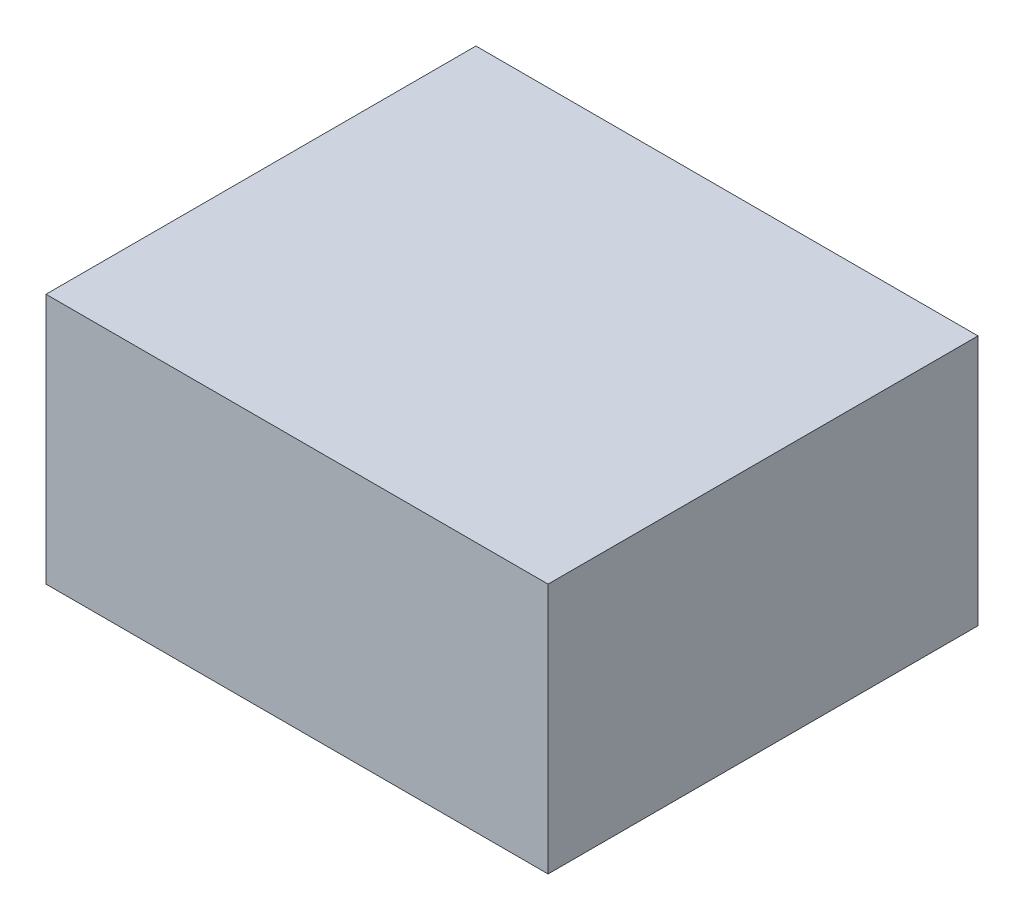
ISO-10303-21;
HEADER;
FILE_DESCRIPTION(('STEP AP214'),'2;1');
FILE_NAME('part.step','',(''),(''),'','','');
FILE_SCHEMA(('AUTOMOTIVE_DESIGN { 1 0 10303 214 1 1 1 1 }'));
ENDSEC;
DATA;
#1=APPLICATION_CONTEXT('core data for automotive mechanical design processes');
#2=APPLICATION_PROTOCOL_DEFINITION('international standard','automotive_design',2000,#1);
#3=PRODUCT_CONTEXT('',#1,'mechanical');
#4=PRODUCT('Part','Part','',(#3));
#5=PRODUCT_RELATED_PRODUCT_CATEGORY('part','',(#4));
#6=PRODUCT_DEFINITION_FORMATION('','',#4);
#7=PRODUCT_DEFINITION_CONTEXT('part definition',#1,'design');
#8=PRODUCT_DEFINITION('design','',#6,#7);
#9=PRODUCT_DEFINITION_SHAPE('','',#8);
#10=(LENGTH_UNIT() NAMED_UNIT(*) SI_UNIT(.MILLI.,.METRE.));
#11=(NAMED_UNIT(*) PLANE_ANGLE_UNIT() SI_UNIT($,.RADIAN.));
#12=(NAMED_UNIT(*) SI_UNIT($,.STERADIAN.) SOLID_ANGLE_UNIT());
#13=UNCERTAINTY_MEASURE_WITH_UNIT(LENGTH_MEASURE(1.E-05),#10,'distance_accuracy_value','');
#14=(GEOMETRIC_REPRESENTATION_CONTEXT(3) GLOBAL_UNCERTAINTY_ASSIGNED_CONTEXT((#13)) GLOBAL_UNIT_ASSIGNED_CONTEXT((#10,
#11,#12)) REPRESENTATION_CONTEXT('',''));
#15=CARTESIAN_POINT('',(0.,0.,0.));
#16=DIRECTION('',(0.,0.,1.));
#17=DIRECTION('',(1.,0.,0.));
#18=AXIS2_PLACEMENT_3D('',#15,#16,#17);
#19=CARTESIAN_POINT('',(0.508,0.254,0.));
#20=DIRECTION('',(0.,-1.,0.));
#21=DIRECTION('',(0.,0.,-1.));
#22=AXIS2_PLACEMENT_3D('',#19,#20,#21);
#23=PLANE('',#22);
#24=DIRECTION('',(0.,0.,-1.));
#25=VECTOR('',#24,1.);
#26=CARTESIAN_POINT('',(-0.508,0.254,0.));
#27=LINE('',#26,#25);
#28=CARTESIAN_POINT('',(-0.508,0.254,0.));
#29=VERTEX_POINT('',#28);
#30=CARTESIAN_POINT('',(-0.508,0.254,0.8700008));
#31=VERTEX_POINT('',#30);
#32=EDGE_CURVE('E20',#29,#31,#27,.F.);
#33=ORIENTED_EDGE('',*,*,#32,.T.);
#34=DIRECTION('',(-1.,0.,0.));
#35=VECTOR('',#34,1.);
#36=CARTESIAN_POINT('',(-0.508,0.254,0.8700008));
#37=LINE('',#36,#35);
#38=CARTESIAN_POINT('',(0.508,0.254,0.8700008));
#39=VERTEX_POINT('',#38);
#40=EDGE_CURVE('E55',#31,#39,#37,.F.);
#41=ORIENTED_EDGE('',*,*,#40,.T.);
#42=DIRECTION('',(0.,0.,1.));
#43=VECTOR('',#42,1.);
#44=CARTESIAN_POINT('',(0.508,0.254,0.));
#45=LINE('',#44,#43);
#46=CARTESIAN_POINT('',(0.508,0.254,0.));
#47=VERTEX_POINT('',#46);
#48=EDGE_CURVE('E74',#39,#47,#45,.F.);
#49=ORIENTED_EDGE('',*,*,#48,.T.);
#50=DIRECTION('',(-1.,0.,0.));
#51=VECTOR('',#50,1.);
#52=CARTESIAN_POINT('',(-0.508,0.254,0.));
#53=LINE('',#52,#51);
#54=EDGE_CURVE('E66',#29,#47,#53,.F.);
#55=ORIENTED_EDGE('',*,*,#54,.F.);
#56=EDGE_LOOP('',(#33,#41,#49,#55));
#57=FACE_BOUND('',#56,.T.);
#58=ADVANCED_FACE('F17',(#57),#23,.F.);
#59=CARTESIAN_POINT('',(-0.508,0.254,0.));
#60=DIRECTION('',(1.,0.,0.));
#61=DIRECTION('',(0.,0.,-1.));
#62=AXIS2_PLACEMENT_3D('',#59,#60,#61);
#63=PLANE('',#62);
#64=DIRECTION('',(0.,0.,1.));
#65=VECTOR('',#64,1.);
#66=CARTESIAN_POINT('',(-0.508,-0.254,0.));
#67=LINE('',#66,#65);
#68=CARTESIAN_POINT('',(-0.508,-0.254,0.));
#69=VERTEX_POINT('',#68);
#70=CARTESIAN_POINT('',(-0.508,-0.254,0.8700008));
#71=VERTEX_POINT('',#70);
#72=EDGE_CURVE('E72',#69,#71,#67,.T.);
#73=ORIENTED_EDGE('',*,*,#72,.T.);
#74=DIRECTION('',(0.,1.,0.));
#75=VECTOR('',#74,1.);
#76=CARTESIAN_POINT('',(-0.508,0.254,0.8700008));
#77=LINE('',#76,#75);
#78=EDGE_CURVE('E62',#71,#31,#77,.T.);
#79=ORIENTED_EDGE('',*,*,#78,.T.);
#80=ORIENTED_EDGE('',*,*,#32,.F.);
#81=DIRECTION('',(0.,1.,0.));
#82=VECTOR('',#81,1.);
#83=CARTESIAN_POINT('',(-0.508,0.254,0.));
#84=LINE('',#83,#82);
#85=EDGE_CURVE('E80',#69,#29,#84,.T.);
#86=ORIENTED_EDGE('',*,*,#85,.F.);
#87=EDGE_LOOP('',(#73,#79,#80,#86));
#88=FACE_BOUND('',#87,.T.);
#89=ADVANCED_FACE('F71',(#88),#63,.F.);
#90=CARTESIAN_POINT('',(-0.508,0.254,0.8700008));
#91=DIRECTION('',(0.,0.,-1.));
#92=DIRECTION('',(-1.,0.,0.));
#93=AXIS2_PLACEMENT_3D('',#90,#91,#92);
#94=PLANE('',#93);
#95=DIRECTION('',(1.,0.,0.));
#96=VECTOR('',#95,1.);
#97=CARTESIAN_POINT('',(-0.508,-0.254,0.8700008));
#98=LINE('',#97,#96);
#99=CARTESIAN_POINT('',(0.508,-0.254,0.8700008));
#100=VERTEX_POINT('',#99);
#101=EDGE_CURVE('E83',#71,#100,#98,.T.);
#102=ORIENTED_EDGE('',*,*,#101,.T.);
#103=DIRECTION('',(0.,1.,0.));
#104=VECTOR('',#103,1.);
#105=CARTESIAN_POINT('',(0.508,-0.254,0.8700008));
#106=LINE('',#105,#104);
#107=EDGE_CURVE('E64',#100,#39,#106,.T.);
#108=ORIENTED_EDGE('',*,*,#107,.T.);
#109=ORIENTED_EDGE('',*,*,#40,.F.);
#110=ORIENTED_EDGE('',*,*,#78,.F.);
#111=EDGE_LOOP('',(#102,#108,#109,#110));
#112=FACE_BOUND('',#111,.T.);
#113=ADVANCED_FACE('F60',(#112),#94,.F.);
#114=CARTESIAN_POINT('',(0.508,-0.254,0.));
#115=DIRECTION('',(-1.,0.,0.));
#116=DIRECTION('',(0.,0.,1.));
#117=AXIS2_PLACEMENT_3D('',#114,#115,#116);
#118=PLANE('',#117);
#119=ORIENTED_EDGE('',*,*,#48,.F.);
#120=ORIENTED_EDGE('',*,*,#107,.F.);
#121=DIRECTION('',(0.,0.,1.));
#122=VECTOR('',#121,1.);
#123=CARTESIAN_POINT('',(0.508,-0.254,0.));
#124=LINE('',#123,#122);
#125=CARTESIAN_POINT('',(0.508,-0.254,0.));
#126=VERTEX_POINT('',#125);
#127=EDGE_CURVE('E26',#100,#126,#124,.F.);
#128=ORIENTED_EDGE('',*,*,#127,.T.);
#129=DIRECTION('',(0.,1.,0.));
#130=VECTOR('',#129,1.);
#131=CARTESIAN_POINT('',(0.508,0.254,0.));
#132=LINE('',#131,#130);
#133=EDGE_CURVE('E34',#47,#126,#132,.F.);
#134=ORIENTED_EDGE('',*,*,#133,.F.);
#135=EDGE_LOOP('',(#119,#120,#128,#134));
#136=FACE_BOUND('',#135,.T.);
#137=ADVANCED_FACE('F88',(#136),#118,.F.);
#138=CARTESIAN_POINT('',(-0.508,0.254,0.));
#139=DIRECTION('',(0.,0.,-1.));
#140=DIRECTION('',(-1.,0.,0.));
#141=AXIS2_PLACEMENT_3D('',#138,#139,#140);
#142=PLANE('',#141);
#143=DIRECTION('',(1.,0.,0.));
#144=VECTOR('',#143,1.);
#145=CARTESIAN_POINT('',(-0.508,-0.254,0.));
#146=LINE('',#145,#144);
#147=EDGE_CURVE('E11',#126,#69,#146,.F.);
#148=ORIENTED_EDGE('',*,*,#147,.T.);
#149=ORIENTED_EDGE('',*,*,#85,.T.);
#150=ORIENTED_EDGE('',*,*,#54,.T.);
#151=ORIENTED_EDGE('',*,*,#133,.T.);
#152=EDGE_LOOP('',(#148,#149,#150,#151));
#153=FACE_BOUND('',#152,.T.);
#154=ADVANCED_FACE('F91',(#153),#142,.T.);
#155=CARTESIAN_POINT('',(-0.508,-0.254,0.));
#156=DIRECTION('',(0.,1.,0.));
#157=DIRECTION('',(0.,0.,1.));
#158=AXIS2_PLACEMENT_3D('',#155,#156,#157);
#159=PLANE('',#158);
#160=ORIENTED_EDGE('',*,*,#127,.F.);
#161=ORIENTED_EDGE('',*,*,#101,.F.);
#162=ORIENTED_EDGE('',*,*,#72,.F.);
#163=ORIENTED_EDGE('',*,*,#147,.F.);
#164=EDGE_LOOP('',(#160,#161,#162,#163));
#165=FACE_BOUND('',#164,.T.);
#166=ADVANCED_FACE('F90',(#165),#159,.F.);
#167=CLOSED_SHELL('',(#58,#89,#113,#137,#154,#166));
#168=MANIFOLD_SOLID_BREP('B1',#167);
#169=ADVANCED_BREP_SHAPE_REPRESENTATION('',(#18,#168),#14);
#170=SHAPE_DEFINITION_REPRESENTATION(#9,#169);
ENDSEC;
END-ISO-10303-21;
